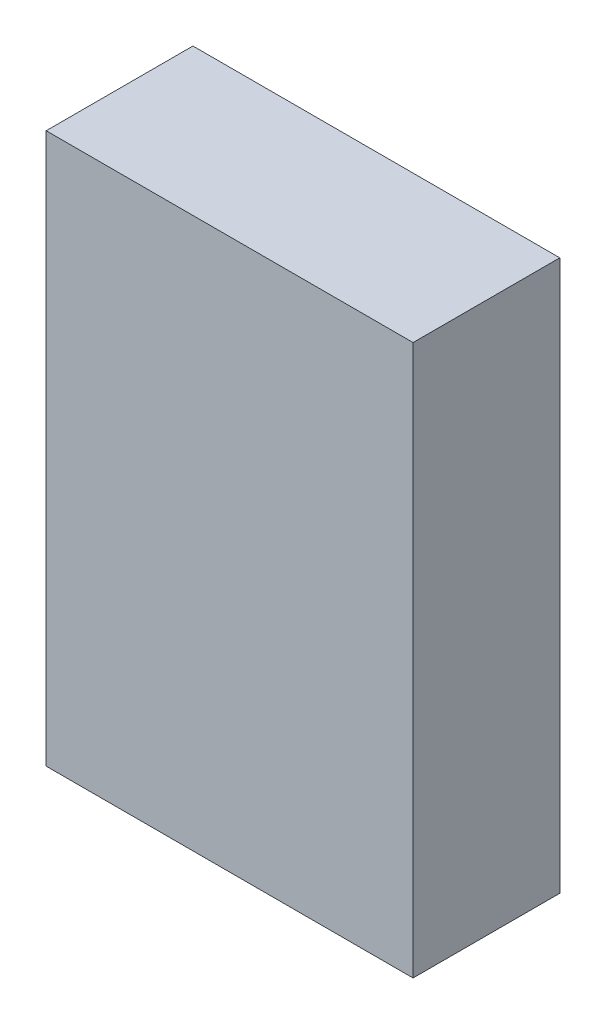
ISO-10303-21;
HEADER;
FILE_DESCRIPTION(('STEP AP214'),'2;1');
FILE_NAME('part.step','',(''),(''),'','','');
FILE_SCHEMA(('AUTOMOTIVE_DESIGN { 1 0 10303 214 1 1 1 1 }'));
ENDSEC;
DATA;
#1=APPLICATION_CONTEXT('core data for automotive mechanical design processes');
#2=APPLICATION_PROTOCOL_DEFINITION('international standard','automotive_design',2000,#1);
#3=PRODUCT_CONTEXT('',#1,'mechanical');
#4=PRODUCT('Part','Part','',(#3));
#5=PRODUCT_RELATED_PRODUCT_CATEGORY('part','',(#4));
#6=PRODUCT_DEFINITION_FORMATION('','',#4);
#7=PRODUCT_DEFINITION_CONTEXT('part definition',#1,'design');
#8=PRODUCT_DEFINITION('design','',#6,#7);
#9=PRODUCT_DEFINITION_SHAPE('','',#8);
#10=(LENGTH_UNIT() NAMED_UNIT(*) SI_UNIT(.MILLI.,.METRE.));
#11=(NAMED_UNIT(*) PLANE_ANGLE_UNIT() SI_UNIT($,.RADIAN.));
#12=(NAMED_UNIT(*) SI_UNIT($,.STERADIAN.) SOLID_ANGLE_UNIT());
#13=UNCERTAINTY_MEASURE_WITH_UNIT(LENGTH_MEASURE(1.E-05),#10,'distance_accuracy_value','');
#14=(GEOMETRIC_REPRESENTATION_CONTEXT(3) GLOBAL_UNCERTAINTY_ASSIGNED_CONTEXT((#13)) GLOBAL_UNIT_ASSIGNED_CONTEXT((#10,
#11,#12)) REPRESENTATION_CONTEXT('',''));
#15=CARTESIAN_POINT('',(0.,0.,0.));
#16=DIRECTION('',(0.,0.,1.));
#17=DIRECTION('',(1.,0.,0.));
#18=AXIS2_PLACEMENT_3D('',#15,#16,#17);
#19=CARTESIAN_POINT('',(0.,0.,20.));
#20=DIRECTION('',(1.,0.,0.));
#21=DIRECTION('',(0.,0.,-1.));
#22=AXIS2_PLACEMENT_3D('',#19,#20,#21);
#23=PLANE('',#22);
#24=DIRECTION('',(0.,-1.,0.));
#25=VECTOR('',#24,1.);
#26=CARTESIAN_POINT('',(0.,0.,0.));
#27=LINE('',#26,#25);
#28=CARTESIAN_POINT('',(0.,75.,0.));
#29=VERTEX_POINT('',#28);
#30=CARTESIAN_POINT('',(0.,0.,0.));
#31=VERTEX_POINT('',#30);
#32=EDGE_CURVE('E96',#29,#31,#27,.T.);
#33=ORIENTED_EDGE('',*,*,#32,.T.);
#34=DIRECTION('',(0.,0.,-1.));
#35=VECTOR('',#34,1.);
#36=CARTESIAN_POINT('',(0.,0.,20.));
#37=LINE('',#36,#35);
#38=CARTESIAN_POINT('',(0.,0.,20.));
#39=VERTEX_POINT('',#38);
#40=EDGE_CURVE('E11',#39,#31,#37,.T.);
#41=ORIENTED_EDGE('',*,*,#40,.F.);
#42=DIRECTION('',(0.,-1.,0.));
#43=VECTOR('',#42,1.);
#44=CARTESIAN_POINT('',(0.,0.,20.));
#45=LINE('',#44,#43);
#46=CARTESIAN_POINT('',(0.,75.,20.));
#47=VERTEX_POINT('',#46);
#48=EDGE_CURVE('E84',#47,#39,#45,.T.);
#49=ORIENTED_EDGE('',*,*,#48,.F.);
#50=DIRECTION('',(0.,0.,-1.));
#51=VECTOR('',#50,1.);
#52=CARTESIAN_POINT('',(0.,75.,20.));
#53=LINE('',#52,#51);
#54=EDGE_CURVE('E92',#47,#29,#53,.T.);
#55=ORIENTED_EDGE('',*,*,#54,.T.);
#56=EDGE_LOOP('',(#33,#41,#49,#55));
#57=FACE_BOUND('',#56,.T.);
#58=ADVANCED_FACE('F33',(#57),#23,.F.);
#59=CARTESIAN_POINT('',(0.,0.,20.));
#60=DIRECTION('',(0.,1.,0.));
#61=DIRECTION('',(0.,0.,1.));
#62=AXIS2_PLACEMENT_3D('',#59,#60,#61);
#63=PLANE('',#62);
#64=DIRECTION('',(1.,0.,0.));
#65=VECTOR('',#64,1.);
#66=CARTESIAN_POINT('',(0.,0.,0.));
#67=LINE('',#66,#65);
#68=CARTESIAN_POINT('',(50.,0.,0.));
#69=VERTEX_POINT('',#68);
#70=EDGE_CURVE('E88',#31,#69,#67,.T.);
#71=ORIENTED_EDGE('',*,*,#70,.T.);
#72=DIRECTION('',(0.,0.,-1.));
#73=VECTOR('',#72,1.);
#74=CARTESIAN_POINT('',(50.,0.,20.));
#75=LINE('',#74,#73);
#76=CARTESIAN_POINT('',(50.,0.,20.));
#77=VERTEX_POINT('',#76);
#78=EDGE_CURVE('E41',#77,#69,#75,.T.);
#79=ORIENTED_EDGE('',*,*,#78,.F.);
#80=DIRECTION('',(1.,0.,0.));
#81=VECTOR('',#80,1.);
#82=CARTESIAN_POINT('',(0.,0.,20.));
#83=LINE('',#82,#81);
#84=EDGE_CURVE('E79',#39,#77,#83,.T.);
#85=ORIENTED_EDGE('',*,*,#84,.F.);
#86=ORIENTED_EDGE('',*,*,#40,.T.);
#87=EDGE_LOOP('',(#71,#79,#85,#86));
#88=FACE_BOUND('',#87,.T.);
#89=ADVANCED_FACE('F87',(#88),#63,.F.);
#90=CARTESIAN_POINT('',(50.,0.,20.));
#91=DIRECTION('',(-1.,0.,0.));
#92=DIRECTION('',(0.,0.,1.));
#93=AXIS2_PLACEMENT_3D('',#90,#91,#92);
#94=PLANE('',#93);
#95=DIRECTION('',(0.,1.,0.));
#96=VECTOR('',#95,1.);
#97=CARTESIAN_POINT('',(50.,0.,0.));
#98=LINE('',#97,#96);
#99=CARTESIAN_POINT('',(50.,75.,0.));
#100=VERTEX_POINT('',#99);
#101=EDGE_CURVE('E66',#69,#100,#98,.T.);
#102=ORIENTED_EDGE('',*,*,#101,.T.);
#103=DIRECTION('',(0.,0.,-1.));
#104=VECTOR('',#103,1.);
#105=CARTESIAN_POINT('',(50.,75.,20.));
#106=LINE('',#105,#104);
#107=CARTESIAN_POINT('',(50.,75.,20.));
#108=VERTEX_POINT('',#107);
#109=EDGE_CURVE('E89',#108,#100,#106,.T.);
#110=ORIENTED_EDGE('',*,*,#109,.F.);
#111=DIRECTION('',(0.,1.,0.));
#112=VECTOR('',#111,1.);
#113=CARTESIAN_POINT('',(50.,0.,20.));
#114=LINE('',#113,#112);
#115=EDGE_CURVE('E82',#77,#108,#114,.T.);
#116=ORIENTED_EDGE('',*,*,#115,.F.);
#117=ORIENTED_EDGE('',*,*,#78,.T.);
#118=EDGE_LOOP('',(#102,#110,#116,#117));
#119=FACE_BOUND('',#118,.T.);
#120=ADVANCED_FACE('F90',(#119),#94,.F.);
#121=CARTESIAN_POINT('',(0.,75.,20.));
#122=DIRECTION('',(0.,-1.,0.));
#123=DIRECTION('',(0.,0.,-1.));
#124=AXIS2_PLACEMENT_3D('',#121,#122,#123);
#125=PLANE('',#124);
#126=DIRECTION('',(-1.,0.,0.));
#127=VECTOR('',#126,1.);
#128=CARTESIAN_POINT('',(0.,75.,0.));
#129=LINE('',#128,#127);
#130=EDGE_CURVE('E72',#100,#29,#129,.T.);
#131=ORIENTED_EDGE('',*,*,#130,.T.);
#132=ORIENTED_EDGE('',*,*,#54,.F.);
#133=DIRECTION('',(-1.,0.,0.));
#134=VECTOR('',#133,1.);
#135=CARTESIAN_POINT('',(0.,75.,20.));
#136=LINE('',#135,#134);
#137=EDGE_CURVE('E49',#108,#47,#136,.T.);
#138=ORIENTED_EDGE('',*,*,#137,.F.);
#139=ORIENTED_EDGE('',*,*,#109,.T.);
#140=EDGE_LOOP('',(#131,#132,#138,#139));
#141=FACE_BOUND('',#140,.T.);
#142=ADVANCED_FACE('F103',(#141),#125,.F.);
#143=CARTESIAN_POINT('',(0.,0.,20.));
#144=DIRECTION('',(0.,0.,-1.));
#145=DIRECTION('',(-1.,0.,0.));
#146=AXIS2_PLACEMENT_3D('',#143,#144,#145);
#147=PLANE('',#146);
#148=ORIENTED_EDGE('',*,*,#48,.T.);
#149=ORIENTED_EDGE('',*,*,#84,.T.);
#150=ORIENTED_EDGE('',*,*,#115,.T.);
#151=ORIENTED_EDGE('',*,*,#137,.T.);
#152=EDGE_LOOP('',(#148,#149,#150,#151));
#153=FACE_BOUND('',#152,.T.);
#154=ADVANCED_FACE('F80',(#153),#147,.F.);
#155=CARTESIAN_POINT('',(0.,0.,0.));
#156=DIRECTION('',(0.,0.,-1.));
#157=DIRECTION('',(-1.,0.,0.));
#158=AXIS2_PLACEMENT_3D('',#155,#156,#157);
#159=PLANE('',#158);
#160=ORIENTED_EDGE('',*,*,#32,.F.);
#161=ORIENTED_EDGE('',*,*,#130,.F.);
#162=ORIENTED_EDGE('',*,*,#101,.F.);
#163=ORIENTED_EDGE('',*,*,#70,.F.);
#164=EDGE_LOOP('',(#160,#161,#162,#163));
#165=FACE_BOUND('',#164,.T.);
#166=ADVANCED_FACE('F106',(#165),#159,.T.);
#167=CLOSED_SHELL('',(#58,#89,#120,#142,#154,#166));
#168=MANIFOLD_SOLID_BREP('B2',#167);
#169=ADVANCED_BREP_SHAPE_REPRESENTATION('',(#18,#168),#14);
#170=SHAPE_DEFINITION_REPRESENTATION(#9,#169);
ENDSEC;
END-ISO-10303-21;
